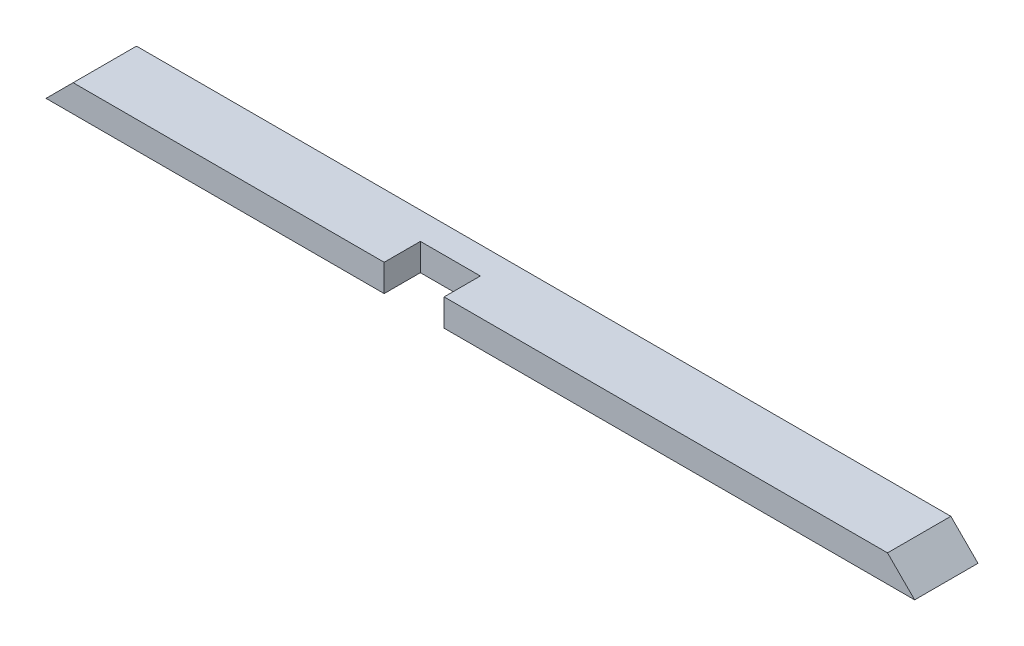
ISO-10303-21;
HEADER;
FILE_DESCRIPTION(('STEP AP214'),'2;1');
FILE_NAME('part.step','',(''),(''),'','','');
FILE_SCHEMA(('AUTOMOTIVE_DESIGN { 1 0 10303 214 1 1 1 1 }'));
ENDSEC;
DATA;
#1=APPLICATION_CONTEXT('core data for automotive mechanical design processes');
#2=APPLICATION_PROTOCOL_DEFINITION('international standard','automotive_design',2000,#1);
#3=PRODUCT_CONTEXT('',#1,'mechanical');
#4=PRODUCT('Part','Part','',(#3));
#5=PRODUCT_RELATED_PRODUCT_CATEGORY('part','',(#4));
#6=PRODUCT_DEFINITION_FORMATION('','',#4);
#7=PRODUCT_DEFINITION_CONTEXT('part definition',#1,'design');
#8=PRODUCT_DEFINITION('design','',#6,#7);
#9=PRODUCT_DEFINITION_SHAPE('','',#8);
#10=(LENGTH_UNIT() NAMED_UNIT(*) SI_UNIT(.MILLI.,.METRE.));
#11=(NAMED_UNIT(*) PLANE_ANGLE_UNIT() SI_UNIT($,.RADIAN.));
#12=(NAMED_UNIT(*) SI_UNIT($,.STERADIAN.) SOLID_ANGLE_UNIT());
#13=UNCERTAINTY_MEASURE_WITH_UNIT(LENGTH_MEASURE(1.E-05),#10,'distance_accuracy_value','');
#14=(GEOMETRIC_REPRESENTATION_CONTEXT(3) GLOBAL_UNCERTAINTY_ASSIGNED_CONTEXT((#13)) GLOBAL_UNIT_ASSIGNED_CONTEXT((#10,
#11,#12)) REPRESENTATION_CONTEXT('',''));
#15=CARTESIAN_POINT('',(0.,0.,0.));
#16=DIRECTION('',(0.,0.,1.));
#17=DIRECTION('',(1.,0.,0.));
#18=AXIS2_PLACEMENT_3D('',#15,#16,#17);
#19=CARTESIAN_POINT('',(0.,38.1,0.));
#20=DIRECTION('',(0.,0.,-1.));
#21=DIRECTION('',(-1.,0.,0.));
#22=AXIS2_PLACEMENT_3D('',#19,#20,#21);
#23=PLANE('',#22);
#24=DIRECTION('',(1.,0.,0.));
#25=VECTOR('',#24,1.);
#26=CARTESIAN_POINT('',(0.,38.1,0.));
#27=LINE('',#26,#25);
#28=CARTESIAN_POINT('',(558.8,38.1,0.));
#29=VERTEX_POINT('',#28);
#30=CARTESIAN_POINT('',(1181.1,38.0999999999999,0.));
#31=VERTEX_POINT('',#30);
#32=EDGE_CURVE('E121',#29,#31,#27,.T.);
#33=ORIENTED_EDGE('',*,*,#32,.F.);
#34=DIRECTION('',(0.,-1.,0.));
#35=VECTOR('',#34,1.);
#36=CARTESIAN_POINT('',(558.8,38.1,0.));
#37=LINE('',#36,#35);
#38=CARTESIAN_POINT('',(558.8,0.,0.));
#39=VERTEX_POINT('',#38);
#40=EDGE_CURVE('E106',#29,#39,#37,.T.);
#41=ORIENTED_EDGE('',*,*,#40,.T.);
#42=DIRECTION('',(1.,0.,0.));
#43=VECTOR('',#42,1.);
#44=CARTESIAN_POINT('',(0.,0.,0.));
#45=LINE('',#44,#43);
#46=CARTESIAN_POINT('',(1219.2,0.,0.));
#47=VERTEX_POINT('',#46);
#48=EDGE_CURVE('E140',#39,#47,#45,.T.);
#49=ORIENTED_EDGE('',*,*,#48,.T.);
#50=DIRECTION('',(0.707106781186549,-0.707106781186546,0.));
#51=VECTOR('',#50,1.);
#52=CARTESIAN_POINT('',(1181.1,38.0999999999999,0.));
#53=LINE('',#52,#51);
#54=EDGE_CURVE('E130',#31,#47,#53,.T.);
#55=ORIENTED_EDGE('',*,*,#54,.F.);
#56=EDGE_LOOP('',(#33,#41,#49,#55));
#57=FACE_BOUND('',#56,.T.);
#58=ADVANCED_FACE('F38',(#57),#23,.F.);
#59=CARTESIAN_POINT('',(0.,0.,0.));
#60=VERTEX_POINT('',#59);
#61=CARTESIAN_POINT('',(474.6625,0.,0.));
#62=VERTEX_POINT('',#61);
#63=EDGE_CURVE('E142',#60,#62,#45,.T.);
#64=ORIENTED_EDGE('',*,*,#63,.T.);
#65=DIRECTION('',(0.,-1.,0.));
#66=VECTOR('',#65,1.);
#67=CARTESIAN_POINT('',(474.6625,38.1,0.));
#68=LINE('',#67,#66);
#69=CARTESIAN_POINT('',(474.6625,38.1,0.));
#70=VERTEX_POINT('',#69);
#71=EDGE_CURVE('E55',#70,#62,#68,.T.);
#72=ORIENTED_EDGE('',*,*,#71,.F.);
#73=CARTESIAN_POINT('',(38.1,38.1,0.));
#74=VERTEX_POINT('',#73);
#75=EDGE_CURVE('E47',#74,#70,#27,.T.);
#76=ORIENTED_EDGE('',*,*,#75,.F.);
#77=DIRECTION('',(0.707106781186547,0.707106781186547,0.));
#78=VECTOR('',#77,1.);
#79=CARTESIAN_POINT('',(0.,0.,0.));
#80=LINE('',#79,#78);
#81=EDGE_CURVE('E159',#60,#74,#80,.T.);
#82=ORIENTED_EDGE('',*,*,#81,.F.);
#83=EDGE_LOOP('',(#64,#72,#76,#82));
#84=FACE_BOUND('',#83,.T.);
#85=ADVANCED_FACE('F40',(#84),#23,.F.);
#86=CARTESIAN_POINT('',(0.,38.1,-88.9));
#87=DIRECTION('',(0.,0.,1.));
#88=DIRECTION('',(1.,0.,0.));
#89=AXIS2_PLACEMENT_3D('',#86,#87,#88);
#90=PLANE('',#89);
#91=DIRECTION('',(-1.,0.,0.));
#92=VECTOR('',#91,1.);
#93=CARTESIAN_POINT('',(0.,0.,-88.9));
#94=LINE('',#93,#92);
#95=CARTESIAN_POINT('',(1219.2,0.,-88.9));
#96=VERTEX_POINT('',#95);
#97=CARTESIAN_POINT('',(0.,0.,-88.9));
#98=VERTEX_POINT('',#97);
#99=EDGE_CURVE('E42',#96,#98,#94,.T.);
#100=ORIENTED_EDGE('',*,*,#99,.T.);
#101=DIRECTION('',(0.707106781186547,0.707106781186547,0.));
#102=VECTOR('',#101,1.);
#103=CARTESIAN_POINT('',(0.,0.,-88.9));
#104=LINE('',#103,#102);
#105=CARTESIAN_POINT('',(38.1,38.1,-88.9));
#106=VERTEX_POINT('',#105);
#107=EDGE_CURVE('E63',#98,#106,#104,.T.);
#108=ORIENTED_EDGE('',*,*,#107,.T.);
#109=DIRECTION('',(-1.,0.,0.));
#110=VECTOR('',#109,1.);
#111=CARTESIAN_POINT('',(0.,38.1,-88.9));
#112=LINE('',#111,#110);
#113=CARTESIAN_POINT('',(1181.1,38.0999999999999,-88.9));
#114=VERTEX_POINT('',#113);
#115=EDGE_CURVE('E11',#114,#106,#112,.T.);
#116=ORIENTED_EDGE('',*,*,#115,.F.);
#117=DIRECTION('',(0.707106781186549,-0.707106781186546,0.));
#118=VECTOR('',#117,1.);
#119=CARTESIAN_POINT('',(1181.1,38.0999999999999,-88.9));
#120=LINE('',#119,#118);
#121=EDGE_CURVE('E135',#114,#96,#120,.T.);
#122=ORIENTED_EDGE('',*,*,#121,.T.);
#123=EDGE_LOOP('',(#100,#108,#116,#122));
#124=FACE_BOUND('',#123,.T.);
#125=ADVANCED_FACE('F152',(#124),#90,.F.);
#126=CARTESIAN_POINT('',(0.,38.1,0.));
#127=DIRECTION('',(0.,-1.,0.));
#128=DIRECTION('',(0.,0.,-1.));
#129=AXIS2_PLACEMENT_3D('',#126,#127,#128);
#130=PLANE('',#129);
#131=DIRECTION('',(1.,0.,0.));
#132=VECTOR('',#131,1.);
#133=CARTESIAN_POINT('',(558.8,38.1,-50.8));
#134=LINE('',#133,#132);
#135=CARTESIAN_POINT('',(474.6625,38.1,-50.8));
#136=VERTEX_POINT('',#135);
#137=CARTESIAN_POINT('',(558.8,38.1,-50.8));
#138=VERTEX_POINT('',#137);
#139=EDGE_CURVE('E116',#136,#138,#134,.T.);
#140=ORIENTED_EDGE('',*,*,#139,.T.);
#141=DIRECTION('',(0.,0.,1.));
#142=VECTOR('',#141,1.);
#143=CARTESIAN_POINT('',(558.8,38.1,0.));
#144=LINE('',#143,#142);
#145=EDGE_CURVE('E109',#138,#29,#144,.T.);
#146=ORIENTED_EDGE('',*,*,#145,.T.);
#147=ORIENTED_EDGE('',*,*,#32,.T.);
#148=DIRECTION('',(0.,0.,1.));
#149=VECTOR('',#148,1.);
#150=CARTESIAN_POINT('',(1181.1,38.0999999999999,-88.9));
#151=LINE('',#150,#149);
#152=EDGE_CURVE('E154',#114,#31,#151,.T.);
#153=ORIENTED_EDGE('',*,*,#152,.F.);
#154=ORIENTED_EDGE('',*,*,#115,.T.);
#155=DIRECTION('',(0.,0.,1.));
#156=VECTOR('',#155,1.);
#157=CARTESIAN_POINT('',(38.1,38.1,-88.9));
#158=LINE('',#157,#156);
#159=EDGE_CURVE('E141',#106,#74,#158,.T.);
#160=ORIENTED_EDGE('',*,*,#159,.T.);
#161=ORIENTED_EDGE('',*,*,#75,.T.);
#162=DIRECTION('',(0.,0.,-1.));
#163=VECTOR('',#162,1.);
#164=CARTESIAN_POINT('',(474.6625,38.1,0.));
#165=LINE('',#164,#163);
#166=EDGE_CURVE('E125',#70,#136,#165,.T.);
#167=ORIENTED_EDGE('',*,*,#166,.T.);
#168=EDGE_LOOP('',(#140,#146,#147,#153,#154,#160,#161,#167));
#169=FACE_BOUND('',#168,.T.);
#170=ADVANCED_FACE('F119',(#169),#130,.F.);
#171=CARTESIAN_POINT('',(0.,0.,0.));
#172=DIRECTION('',(0.,-1.,0.));
#173=DIRECTION('',(0.,0.,-1.));
#174=AXIS2_PLACEMENT_3D('',#171,#172,#173);
#175=PLANE('',#174);
#176=DIRECTION('',(0.,0.,1.));
#177=VECTOR('',#176,1.);
#178=CARTESIAN_POINT('',(558.8,0.,0.));
#179=LINE('',#178,#177);
#180=CARTESIAN_POINT('',(558.8,0.,-50.8));
#181=VERTEX_POINT('',#180);
#182=EDGE_CURVE('E112',#181,#39,#179,.T.);
#183=ORIENTED_EDGE('',*,*,#182,.F.);
#184=DIRECTION('',(1.,0.,0.));
#185=VECTOR('',#184,1.);
#186=CARTESIAN_POINT('',(558.8,0.,-50.8));
#187=LINE('',#186,#185);
#188=CARTESIAN_POINT('',(474.6625,0.,-50.8));
#189=VERTEX_POINT('',#188);
#190=EDGE_CURVE('E126',#189,#181,#187,.T.);
#191=ORIENTED_EDGE('',*,*,#190,.F.);
#192=DIRECTION('',(0.,0.,-1.));
#193=VECTOR('',#192,1.);
#194=CARTESIAN_POINT('',(474.6625,0.,0.));
#195=LINE('',#194,#193);
#196=EDGE_CURVE('E175',#62,#189,#195,.T.);
#197=ORIENTED_EDGE('',*,*,#196,.F.);
#198=ORIENTED_EDGE('',*,*,#63,.F.);
#199=DIRECTION('',(0.,0.,1.));
#200=VECTOR('',#199,1.);
#201=CARTESIAN_POINT('',(0.,0.,0.));
#202=LINE('',#201,#200);
#203=EDGE_CURVE('E138',#98,#60,#202,.T.);
#204=ORIENTED_EDGE('',*,*,#203,.F.);
#205=ORIENTED_EDGE('',*,*,#99,.F.);
#206=DIRECTION('',(0.,0.,-1.));
#207=VECTOR('',#206,1.);
#208=CARTESIAN_POINT('',(1219.2,0.,0.));
#209=LINE('',#208,#207);
#210=EDGE_CURVE('E133',#47,#96,#209,.T.);
#211=ORIENTED_EDGE('',*,*,#210,.F.);
#212=ORIENTED_EDGE('',*,*,#48,.F.);
#213=EDGE_LOOP('',(#183,#191,#197,#198,#204,#205,#211,#212));
#214=FACE_BOUND('',#213,.T.);
#215=ADVANCED_FACE('F155',(#214),#175,.T.);
#216=CARTESIAN_POINT('',(1181.1,38.0999999999999,-88.9));
#217=DIRECTION('',(-0.707106781186546,-0.707106781186549,0.));
#218=DIRECTION('',(0.707106781186549,-0.707106781186546,0.));
#219=AXIS2_PLACEMENT_3D('',#216,#217,#218);
#220=PLANE('',#219);
#221=ORIENTED_EDGE('',*,*,#54,.T.);
#222=ORIENTED_EDGE('',*,*,#210,.T.);
#223=ORIENTED_EDGE('',*,*,#121,.F.);
#224=ORIENTED_EDGE('',*,*,#152,.T.);
#225=EDGE_LOOP('',(#221,#222,#223,#224));
#226=FACE_BOUND('',#225,.T.);
#227=ADVANCED_FACE('F147',(#226),#220,.F.);
#228=CARTESIAN_POINT('',(0.,0.,-88.9));
#229=DIRECTION('',(0.707106781186547,-0.707106781186547,0.));
#230=DIRECTION('',(0.707106781186548,0.707106781186548,0.));
#231=AXIS2_PLACEMENT_3D('',#228,#229,#230);
#232=PLANE('',#231);
#233=ORIENTED_EDGE('',*,*,#81,.T.);
#234=ORIENTED_EDGE('',*,*,#159,.F.);
#235=ORIENTED_EDGE('',*,*,#107,.F.);
#236=ORIENTED_EDGE('',*,*,#203,.T.);
#237=EDGE_LOOP('',(#233,#234,#235,#236));
#238=FACE_BOUND('',#237,.T.);
#239=ADVANCED_FACE('F158',(#238),#232,.F.);
#240=CARTESIAN_POINT('',(558.8,38.1,0.));
#241=DIRECTION('',(1.,0.,0.));
#242=DIRECTION('',(0.,0.,-1.));
#243=AXIS2_PLACEMENT_3D('',#240,#241,#242);
#244=PLANE('',#243);
#245=ORIENTED_EDGE('',*,*,#182,.T.);
#246=ORIENTED_EDGE('',*,*,#40,.F.);
#247=ORIENTED_EDGE('',*,*,#145,.F.);
#248=DIRECTION('',(0.,-1.,0.));
#249=VECTOR('',#248,1.);
#250=CARTESIAN_POINT('',(558.8,38.1,-50.8));
#251=LINE('',#250,#249);
#252=EDGE_CURVE('E167',#138,#181,#251,.T.);
#253=ORIENTED_EDGE('',*,*,#252,.T.);
#254=EDGE_LOOP('',(#245,#246,#247,#253));
#255=FACE_BOUND('',#254,.T.);
#256=ADVANCED_FACE('F108',(#255),#244,.F.);
#257=CARTESIAN_POINT('',(558.8,38.1,-50.8));
#258=DIRECTION('',(0.,0.,-1.));
#259=DIRECTION('',(-1.,0.,0.));
#260=AXIS2_PLACEMENT_3D('',#257,#258,#259);
#261=PLANE('',#260);
#262=ORIENTED_EDGE('',*,*,#190,.T.);
#263=ORIENTED_EDGE('',*,*,#252,.F.);
#264=ORIENTED_EDGE('',*,*,#139,.F.);
#265=DIRECTION('',(0.,-1.,0.));
#266=VECTOR('',#265,1.);
#267=CARTESIAN_POINT('',(474.6625,38.1,-50.8));
#268=LINE('',#267,#266);
#269=EDGE_CURVE('E168',#136,#189,#268,.T.);
#270=ORIENTED_EDGE('',*,*,#269,.T.);
#271=EDGE_LOOP('',(#262,#263,#264,#270));
#272=FACE_BOUND('',#271,.T.);
#273=ADVANCED_FACE('F182',(#272),#261,.F.);
#274=CARTESIAN_POINT('',(474.6625,38.1,0.));
#275=DIRECTION('',(-1.,0.,0.));
#276=DIRECTION('',(0.,0.,1.));
#277=AXIS2_PLACEMENT_3D('',#274,#275,#276);
#278=PLANE('',#277);
#279=ORIENTED_EDGE('',*,*,#196,.T.);
#280=ORIENTED_EDGE('',*,*,#269,.F.);
#281=ORIENTED_EDGE('',*,*,#166,.F.);
#282=ORIENTED_EDGE('',*,*,#71,.T.);
#283=EDGE_LOOP('',(#279,#280,#281,#282));
#284=FACE_BOUND('',#283,.T.);
#285=ADVANCED_FACE('F179',(#284),#278,.F.);
#286=CLOSED_SHELL('',(#58,#85,#125,#170,#215,#227,#239,#256,#273,#285));
#287=MANIFOLD_SOLID_BREP('B2',#286);
#288=ADVANCED_BREP_SHAPE_REPRESENTATION('',(#18,#287),#14);
#289=SHAPE_DEFINITION_REPRESENTATION(#9,#288);
ENDSEC;
END-ISO-10303-21;
